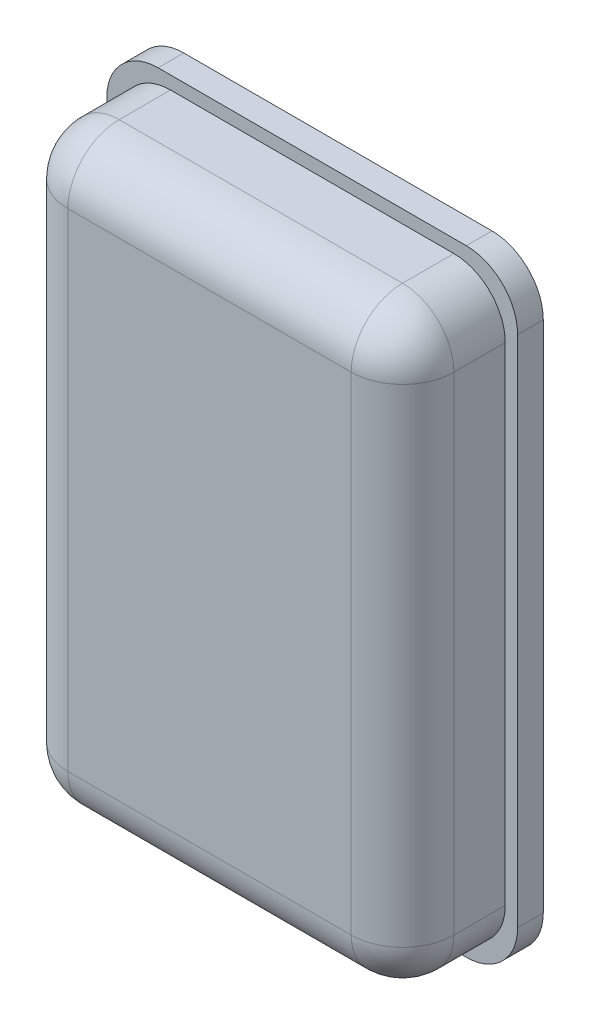
ISO-10303-21;
HEADER;
FILE_DESCRIPTION(('STEP AP214'),'2;1');
FILE_NAME('part.step','',(''),(''),'','','');
FILE_SCHEMA(('AUTOMOTIVE_DESIGN { 1 0 10303 214 1 1 1 1 }'));
ENDSEC;
DATA;
#1=APPLICATION_CONTEXT('core data for automotive mechanical design processes');
#2=APPLICATION_PROTOCOL_DEFINITION('international standard','automotive_design',2000,#1);
#3=PRODUCT_CONTEXT('',#1,'mechanical');
#4=PRODUCT('Part','Part','',(#3));
#5=PRODUCT_RELATED_PRODUCT_CATEGORY('part','',(#4));
#6=PRODUCT_DEFINITION_FORMATION('','',#4);
#7=PRODUCT_DEFINITION_CONTEXT('part definition',#1,'design');
#8=PRODUCT_DEFINITION('design','',#6,#7);
#9=PRODUCT_DEFINITION_SHAPE('','',#8);
#10=(LENGTH_UNIT() NAMED_UNIT(*) SI_UNIT(.MILLI.,.METRE.));
#11=(NAMED_UNIT(*) PLANE_ANGLE_UNIT() SI_UNIT($,.RADIAN.));
#12=(NAMED_UNIT(*) SI_UNIT($,.STERADIAN.) SOLID_ANGLE_UNIT());
#13=UNCERTAINTY_MEASURE_WITH_UNIT(LENGTH_MEASURE(1.E-05),#10,'distance_accuracy_value','');
#14=(GEOMETRIC_REPRESENTATION_CONTEXT(3) GLOBAL_UNCERTAINTY_ASSIGNED_CONTEXT((#13)) GLOBAL_UNIT_ASSIGNED_CONTEXT((#10,
#11,#12)) REPRESENTATION_CONTEXT('',''));
#15=CARTESIAN_POINT('',(0.,0.,0.));
#16=DIRECTION('',(0.,0.,1.));
#17=DIRECTION('',(1.,0.,0.));
#18=AXIS2_PLACEMENT_3D('',#15,#16,#17);
#19=CARTESIAN_POINT('',(37.5887952689364,57.4644174029834,25.));
#20=DIRECTION('',(-1.,0.,0.));
#21=DIRECTION('',(0.,0.,1.));
#22=AXIS2_PLACEMENT_3D('',#19,#20,#21);
#23=PLANE('',#22);
#24=DIRECTION('',(0.,1.,0.));
#25=VECTOR('',#24,1.);
#26=CARTESIAN_POINT('',(37.5887952689364,-57.4644174029834,15.));
#27=LINE('',#26,#25);
#28=CARTESIAN_POINT('',(37.5887952689364,47.4644174029834,15.));
#29=VERTEX_POINT('',#28);
#30=CARTESIAN_POINT('',(37.5887952689364,-47.4644174029834,15.));
#31=VERTEX_POINT('',#30);
#32=EDGE_CURVE('E67',#29,#31,#27,.F.);
#33=ORIENTED_EDGE('',*,*,#32,.T.);
#34=DIRECTION('',(0.,0.,-1.));
#35=VECTOR('',#34,1.);
#36=CARTESIAN_POINT('',(37.5887952689364,-47.4644174029834,25.));
#37=LINE('',#36,#35);
#38=CARTESIAN_POINT('',(37.5887952689364,-47.4644174029834,5.));
#39=VERTEX_POINT('',#38);
#40=EDGE_CURVE('E202',#31,#39,#37,.T.);
#41=ORIENTED_EDGE('',*,*,#40,.T.);
#42=DIRECTION('',(0.,1.,0.));
#43=VECTOR('',#42,1.);
#44=CARTESIAN_POINT('',(37.5887952689364,57.4644174029834,5.));
#45=LINE('',#44,#43);
#46=CARTESIAN_POINT('',(37.5887952689364,47.4644174029834,5.));
#47=VERTEX_POINT('',#46);
#48=EDGE_CURVE('E245',#39,#47,#45,.T.);
#49=ORIENTED_EDGE('',*,*,#48,.T.);
#50=DIRECTION('',(0.,0.,-1.));
#51=VECTOR('',#50,1.);
#52=CARTESIAN_POINT('',(37.5887952689364,47.4644174029834,25.));
#53=LINE('',#52,#51);
#54=EDGE_CURVE('E72',#47,#29,#53,.F.);
#55=ORIENTED_EDGE('',*,*,#54,.T.);
#56=EDGE_LOOP('',(#33,#41,#49,#55));
#57=FACE_BOUND('',#56,.T.);
#58=ADVANCED_FACE('F49',(#57),#23,.F.);
#59=CARTESIAN_POINT('',(-37.5887952689364,57.4644174029834,25.));
#60=DIRECTION('',(0.,-1.,0.));
#61=DIRECTION('',(0.,0.,-1.));
#62=AXIS2_PLACEMENT_3D('',#59,#60,#61);
#63=PLANE('',#62);
#64=DIRECTION('',(-1.,0.,0.));
#65=VECTOR('',#64,1.);
#66=CARTESIAN_POINT('',(-37.5887952689364,57.4644174029834,5.));
#67=LINE('',#66,#65);
#68=CARTESIAN_POINT('',(27.5887952689364,57.4644174029834,5.));
#69=VERTEX_POINT('',#68);
#70=CARTESIAN_POINT('',(-27.5887952689364,57.4644174029834,5.));
#71=VERTEX_POINT('',#70);
#72=EDGE_CURVE('E248',#69,#71,#67,.T.);
#73=ORIENTED_EDGE('',*,*,#72,.T.);
#74=DIRECTION('',(0.,0.,-1.));
#75=VECTOR('',#74,1.);
#76=CARTESIAN_POINT('',(-27.5887952689364,57.4644174029834,25.));
#77=LINE('',#76,#75);
#78=CARTESIAN_POINT('',(-27.5887952689364,57.4644174029834,15.));
#79=VERTEX_POINT('',#78);
#80=EDGE_CURVE('E195',#71,#79,#77,.F.);
#81=ORIENTED_EDGE('',*,*,#80,.T.);
#82=DIRECTION('',(-1.,0.,0.));
#83=VECTOR('',#82,1.);
#84=CARTESIAN_POINT('',(37.5887952689364,57.4644174029834,15.));
#85=LINE('',#84,#83);
#86=CARTESIAN_POINT('',(27.5887952689364,57.4644174029834,15.));
#87=VERTEX_POINT('',#86);
#88=EDGE_CURVE('E192',#79,#87,#85,.F.);
#89=ORIENTED_EDGE('',*,*,#88,.T.);
#90=DIRECTION('',(0.,0.,-1.));
#91=VECTOR('',#90,1.);
#92=CARTESIAN_POINT('',(27.5887952689364,57.4644174029834,25.));
#93=LINE('',#92,#91);
#94=EDGE_CURVE('E189',#87,#69,#93,.T.);
#95=ORIENTED_EDGE('',*,*,#94,.T.);
#96=EDGE_LOOP('',(#73,#81,#89,#95));
#97=FACE_BOUND('',#96,.T.);
#98=ADVANCED_FACE('F305',(#97),#63,.F.);
#99=CARTESIAN_POINT('',(-37.5887952689364,57.4644174029834,25.));
#100=DIRECTION('',(1.,0.,0.));
#101=DIRECTION('',(0.,0.,-1.));
#102=AXIS2_PLACEMENT_3D('',#99,#100,#101);
#103=PLANE('',#102);
#104=DIRECTION('',(0.,-1.,0.));
#105=VECTOR('',#104,1.);
#106=CARTESIAN_POINT('',(-37.5887952689364,57.4644174029834,15.));
#107=LINE('',#106,#105);
#108=CARTESIAN_POINT('',(-37.5887952689364,-47.4644174029834,15.));
#109=VERTEX_POINT('',#108);
#110=CARTESIAN_POINT('',(-37.5887952689364,47.4644174029834,15.));
#111=VERTEX_POINT('',#110);
#112=EDGE_CURVE('E183',#109,#111,#107,.F.);
#113=ORIENTED_EDGE('',*,*,#112,.T.);
#114=DIRECTION('',(0.,0.,-1.));
#115=VECTOR('',#114,1.);
#116=CARTESIAN_POINT('',(-37.5887952689364,47.4644174029834,25.));
#117=LINE('',#116,#115);
#118=CARTESIAN_POINT('',(-37.5887952689364,47.4644174029834,5.));
#119=VERTEX_POINT('',#118);
#120=EDGE_CURVE('E186',#111,#119,#117,.T.);
#121=ORIENTED_EDGE('',*,*,#120,.T.);
#122=DIRECTION('',(0.,-1.,0.));
#123=VECTOR('',#122,1.);
#124=CARTESIAN_POINT('',(-37.5887952689364,57.4644174029834,5.));
#125=LINE('',#124,#123);
#126=CARTESIAN_POINT('',(-37.5887952689364,-47.4644174029834,5.));
#127=VERTEX_POINT('',#126);
#128=EDGE_CURVE('E253',#119,#127,#125,.T.);
#129=ORIENTED_EDGE('',*,*,#128,.T.);
#130=DIRECTION('',(0.,0.,-1.));
#131=VECTOR('',#130,1.);
#132=CARTESIAN_POINT('',(-37.5887952689364,-47.4644174029834,25.));
#133=LINE('',#132,#131);
#134=EDGE_CURVE('E180',#127,#109,#133,.F.);
#135=ORIENTED_EDGE('',*,*,#134,.T.);
#136=EDGE_LOOP('',(#113,#121,#129,#135));
#137=FACE_BOUND('',#136,.T.);
#138=ADVANCED_FACE('F310',(#137),#103,.F.);
#139=CARTESIAN_POINT('',(-37.5887952689364,-57.4644174029834,25.));
#140=DIRECTION('',(0.,1.,0.));
#141=DIRECTION('',(0.,0.,1.));
#142=AXIS2_PLACEMENT_3D('',#139,#140,#141);
#143=PLANE('',#142);
#144=DIRECTION('',(1.,0.,0.));
#145=VECTOR('',#144,1.);
#146=CARTESIAN_POINT('',(-37.5887952689364,-57.4644174029834,15.));
#147=LINE('',#146,#145);
#148=CARTESIAN_POINT('',(27.5887952689364,-57.4644174029834,15.));
#149=VERTEX_POINT('',#148);
#150=CARTESIAN_POINT('',(-27.5887952689364,-57.4644174029834,15.));
#151=VERTEX_POINT('',#150);
#152=EDGE_CURVE('E135',#149,#151,#147,.F.);
#153=ORIENTED_EDGE('',*,*,#152,.T.);
#154=DIRECTION('',(0.,0.,-1.));
#155=VECTOR('',#154,1.);
#156=CARTESIAN_POINT('',(-27.5887952689364,-57.4644174029834,25.));
#157=LINE('',#156,#155);
#158=CARTESIAN_POINT('',(-27.5887952689364,-57.4644174029834,5.));
#159=VERTEX_POINT('',#158);
#160=EDGE_CURVE('E177',#151,#159,#157,.T.);
#161=ORIENTED_EDGE('',*,*,#160,.T.);
#162=DIRECTION('',(1.,0.,0.));
#163=VECTOR('',#162,1.);
#164=CARTESIAN_POINT('',(-37.5887952689364,-57.4644174029834,5.));
#165=LINE('',#164,#163);
#166=CARTESIAN_POINT('',(27.5887952689364,-57.4644174029834,5.));
#167=VERTEX_POINT('',#166);
#168=EDGE_CURVE('E160',#159,#167,#165,.T.);
#169=ORIENTED_EDGE('',*,*,#168,.T.);
#170=DIRECTION('',(0.,0.,-1.));
#171=VECTOR('',#170,1.);
#172=CARTESIAN_POINT('',(27.5887952689364,-57.4644174029834,25.));
#173=LINE('',#172,#171);
#174=EDGE_CURVE('E167',#167,#149,#173,.F.);
#175=ORIENTED_EDGE('',*,*,#174,.T.);
#176=EDGE_LOOP('',(#153,#161,#169,#175));
#177=FACE_BOUND('',#176,.T.);
#178=ADVANCED_FACE('F281',(#177),#143,.F.);
#179=CARTESIAN_POINT('',(0.,0.,25.));
#180=DIRECTION('',(0.,0.,1.));
#181=DIRECTION('',(1.,0.,0.));
#182=AXIS2_PLACEMENT_3D('',#179,#180,#181);
#183=PLANE('',#182);
#184=DIRECTION('',(0.,-1.,0.));
#185=VECTOR('',#184,1.);
#186=CARTESIAN_POINT('',(-27.5887952689364,-57.4644174029834,25.));
#187=LINE('',#186,#185);
#188=CARTESIAN_POINT('',(-27.5887952689364,47.4644174029834,25.));
#189=VERTEX_POINT('',#188);
#190=CARTESIAN_POINT('',(-27.5887952689364,-47.4644174029834,25.));
#191=VERTEX_POINT('',#190);
#192=EDGE_CURVE('E164',#189,#191,#187,.T.);
#193=ORIENTED_EDGE('',*,*,#192,.T.);
#194=DIRECTION('',(1.,0.,0.));
#195=VECTOR('',#194,1.);
#196=CARTESIAN_POINT('',(37.5887952689364,-47.4644174029834,25.));
#197=LINE('',#196,#195);
#198=CARTESIAN_POINT('',(27.5887952689364,-47.4644174029834,25.));
#199=VERTEX_POINT('',#198);
#200=EDGE_CURVE('E133',#191,#199,#197,.T.);
#201=ORIENTED_EDGE('',*,*,#200,.T.);
#202=DIRECTION('',(0.,1.,0.));
#203=VECTOR('',#202,1.);
#204=CARTESIAN_POINT('',(27.5887952689364,57.4644174029834,25.));
#205=LINE('',#204,#203);
#206=CARTESIAN_POINT('',(27.5887952689364,47.4644174029834,25.));
#207=VERTEX_POINT('',#206);
#208=EDGE_CURVE('E152',#199,#207,#205,.T.);
#209=ORIENTED_EDGE('',*,*,#208,.T.);
#210=DIRECTION('',(-1.,0.,0.));
#211=VECTOR('',#210,1.);
#212=CARTESIAN_POINT('',(-37.5887952689364,47.4644174029834,25.));
#213=LINE('',#212,#211);
#214=EDGE_CURVE('E159',#207,#189,#213,.T.);
#215=ORIENTED_EDGE('',*,*,#214,.T.);
#216=EDGE_LOOP('',(#193,#201,#209,#215));
#217=FACE_BOUND('',#216,.T.);
#218=ADVANCED_FACE('F162',(#217),#183,.T.);
#219=CARTESIAN_POINT('',(0.,0.,5.));
#220=DIRECTION('',(0.,0.,1.));
#221=DIRECTION('',(1.,0.,0.));
#222=AXIS2_PLACEMENT_3D('',#219,#220,#221);
#223=PLANE('',#222);
#224=ORIENTED_EDGE('',*,*,#128,.F.);
#225=CARTESIAN_POINT('',(-27.5887952689364,47.4644174029834,5.));
#226=DIRECTION('',(0.,0.,1.));
#227=DIRECTION('',(1.,0.,0.));
#228=AXIS2_PLACEMENT_3D('',#225,#226,#227);
#229=CIRCLE('',#228,10.);
#230=EDGE_CURVE('E12',#119,#71,#229,.F.);
#231=ORIENTED_EDGE('',*,*,#230,.T.);
#232=ORIENTED_EDGE('',*,*,#72,.F.);
#233=CARTESIAN_POINT('',(27.5887952689364,47.4644174029834,5.));
#234=DIRECTION('',(0.,0.,1.));
#235=DIRECTION('',(1.,0.,0.));
#236=AXIS2_PLACEMENT_3D('',#233,#234,#235);
#237=CIRCLE('',#236,10.);
#238=EDGE_CURVE('E205',#69,#47,#237,.F.);
#239=ORIENTED_EDGE('',*,*,#238,.T.);
#240=ORIENTED_EDGE('',*,*,#48,.F.);
#241=CARTESIAN_POINT('',(27.5887952689364,-47.4644174029834,5.));
#242=DIRECTION('',(0.,0.,1.));
#243=DIRECTION('',(1.,0.,0.));
#244=AXIS2_PLACEMENT_3D('',#241,#242,#243);
#245=CIRCLE('',#244,10.);
#246=EDGE_CURVE('E208',#39,#167,#245,.F.);
#247=ORIENTED_EDGE('',*,*,#246,.T.);
#248=ORIENTED_EDGE('',*,*,#168,.F.);
#249=CARTESIAN_POINT('',(-27.5887952689364,-47.4644174029834,5.));
#250=DIRECTION('',(0.,0.,1.));
#251=DIRECTION('',(1.,0.,0.));
#252=AXIS2_PLACEMENT_3D('',#249,#250,#251);
#253=CIRCLE('',#252,10.);
#254=EDGE_CURVE('E59',#159,#127,#253,.F.);
#255=ORIENTED_EDGE('',*,*,#254,.T.);
#256=EDGE_LOOP('',(#224,#231,#232,#239,#240,#247,#248,#255));
#257=FACE_BOUND('',#256,.T.);
#258=ADVANCED_FACE('F288',(#257),#223,.F.);
#259=CARTESIAN_POINT('',(-27.5887952689364,47.4644174029834,25.));
#260=DIRECTION('',(0.,0.,-1.));
#261=DIRECTION('',(-1.,0.,0.));
#262=AXIS2_PLACEMENT_3D('',#259,#260,#261);
#263=CYLINDRICAL_SURFACE('',#262,10.);
#264=ORIENTED_EDGE('',*,*,#230,.F.);
#265=ORIENTED_EDGE('',*,*,#120,.F.);
#266=CARTESIAN_POINT('',(-27.5887952689364,47.4644174029834,15.));
#267=DIRECTION('',(0.,0.,1.));
#268=DIRECTION('',(1.,0.,0.));
#269=AXIS2_PLACEMENT_3D('',#266,#267,#268);
#270=CIRCLE('',#269,10.);
#271=EDGE_CURVE('E53',#79,#111,#270,.T.);
#272=ORIENTED_EDGE('',*,*,#271,.F.);
#273=ORIENTED_EDGE('',*,*,#80,.F.);
#274=EDGE_LOOP('',(#264,#265,#272,#273));
#275=FACE_BOUND('',#274,.T.);
#276=ADVANCED_FACE('F51',(#275),#263,.T.);
#277=CARTESIAN_POINT('',(0.,47.4644174029834,15.));
#278=DIRECTION('',(1.,0.,0.));
#279=DIRECTION('',(0.,0.,-1.));
#280=AXIS2_PLACEMENT_3D('',#277,#278,#279);
#281=CYLINDRICAL_SURFACE('',#280,10.);
#282=CARTESIAN_POINT('',(27.5887952689364,47.4644174029834,15.));
#283=DIRECTION('',(1.,0.,0.));
#284=DIRECTION('',(0.,0.,-1.));
#285=AXIS2_PLACEMENT_3D('',#282,#283,#284);
#286=CIRCLE('',#285,10.);
#287=EDGE_CURVE('E234',#87,#207,#286,.T.);
#288=ORIENTED_EDGE('',*,*,#287,.F.);
#289=ORIENTED_EDGE('',*,*,#88,.F.);
#290=CARTESIAN_POINT('',(-27.5887952689364,47.4644174029834,15.));
#291=DIRECTION('',(-1.,0.,0.));
#292=DIRECTION('',(0.,0.,1.));
#293=AXIS2_PLACEMENT_3D('',#290,#291,#292);
#294=CIRCLE('',#293,10.);
#295=EDGE_CURVE('E237',#189,#79,#294,.T.);
#296=ORIENTED_EDGE('',*,*,#295,.F.);
#297=ORIENTED_EDGE('',*,*,#214,.F.);
#298=EDGE_LOOP('',(#288,#289,#296,#297));
#299=FACE_BOUND('',#298,.T.);
#300=ADVANCED_FACE('F265',(#299),#281,.T.);
#301=CARTESIAN_POINT('',(27.5887952689364,47.4644174029834,25.));
#302=DIRECTION('',(0.,0.,-1.));
#303=DIRECTION('',(-1.,0.,0.));
#304=AXIS2_PLACEMENT_3D('',#301,#302,#303);
#305=CYLINDRICAL_SURFACE('',#304,10.);
#306=ORIENTED_EDGE('',*,*,#238,.F.);
#307=ORIENTED_EDGE('',*,*,#94,.F.);
#308=CARTESIAN_POINT('',(27.5887952689364,47.4644174029834,15.));
#309=DIRECTION('',(0.,0.,1.));
#310=DIRECTION('',(1.,0.,0.));
#311=AXIS2_PLACEMENT_3D('',#308,#309,#310);
#312=CIRCLE('',#311,10.);
#313=EDGE_CURVE('E230',#29,#87,#312,.T.);
#314=ORIENTED_EDGE('',*,*,#313,.F.);
#315=ORIENTED_EDGE('',*,*,#54,.F.);
#316=EDGE_LOOP('',(#306,#307,#314,#315));
#317=FACE_BOUND('',#316,.T.);
#318=ADVANCED_FACE('F293',(#317),#305,.T.);
#319=CARTESIAN_POINT('',(-27.5887952689364,47.4644174029834,15.));
#320=DIRECTION('',(0.,1.,0.));
#321=DIRECTION('',(0.,0.,1.));
#322=AXIS2_PLACEMENT_3D('',#319,#320,#321);
#323=SPHERICAL_SURFACE('',#322,10.);
#324=ORIENTED_EDGE('',*,*,#295,.T.);
#325=ORIENTED_EDGE('',*,*,#271,.T.);
#326=CARTESIAN_POINT('',(-27.5887952689364,47.4644174029834,15.));
#327=DIRECTION('',(0.,1.,0.));
#328=DIRECTION('',(0.,0.,1.));
#329=AXIS2_PLACEMENT_3D('',#326,#327,#328);
#330=CIRCLE('',#329,10.);
#331=EDGE_CURVE('E226',#189,#111,#330,.F.);
#332=ORIENTED_EDGE('',*,*,#331,.F.);
#333=EDGE_LOOP('',(#324,#325,#332));
#334=FACE_BOUND('',#333,.T.);
#335=ADVANCED_FACE('F266',(#334),#323,.T.);
#336=CARTESIAN_POINT('',(27.5887952689364,47.4644174029834,15.));
#337=DIRECTION('',(0.,1.,0.));
#338=DIRECTION('',(-1.,0.,0.));
#339=AXIS2_PLACEMENT_3D('',#336,#337,#338);
#340=SPHERICAL_SURFACE('',#339,10.);
#341=ORIENTED_EDGE('',*,*,#313,.T.);
#342=ORIENTED_EDGE('',*,*,#287,.T.);
#343=CARTESIAN_POINT('',(27.5887952689364,47.4644174029834,15.));
#344=DIRECTION('',(0.,1.,0.));
#345=DIRECTION('',(0.,0.,1.));
#346=AXIS2_PLACEMENT_3D('',#343,#344,#345);
#347=CIRCLE('',#346,10.);
#348=EDGE_CURVE('E155',#29,#207,#347,.F.);
#349=ORIENTED_EDGE('',*,*,#348,.F.);
#350=EDGE_LOOP('',(#341,#342,#349));
#351=FACE_BOUND('',#350,.T.);
#352=ADVANCED_FACE('F295',(#351),#340,.T.);
#353=CARTESIAN_POINT('',(-27.5887952689364,-47.4644174029834,25.));
#354=DIRECTION('',(0.,0.,-1.));
#355=DIRECTION('',(-1.,0.,0.));
#356=AXIS2_PLACEMENT_3D('',#353,#354,#355);
#357=CYLINDRICAL_SURFACE('',#356,10.);
#358=ORIENTED_EDGE('',*,*,#254,.F.);
#359=ORIENTED_EDGE('',*,*,#160,.F.);
#360=CARTESIAN_POINT('',(-27.5887952689364,-47.4644174029834,15.));
#361=DIRECTION('',(0.,0.,1.));
#362=DIRECTION('',(1.,0.,0.));
#363=AXIS2_PLACEMENT_3D('',#360,#361,#362);
#364=CIRCLE('',#363,10.);
#365=EDGE_CURVE('E220',#109,#151,#364,.T.);
#366=ORIENTED_EDGE('',*,*,#365,.F.);
#367=ORIENTED_EDGE('',*,*,#134,.F.);
#368=EDGE_LOOP('',(#358,#359,#366,#367));
#369=FACE_BOUND('',#368,.T.);
#370=ADVANCED_FACE('F278',(#369),#357,.T.);
#371=CARTESIAN_POINT('',(-27.5887952689364,0.,15.));
#372=DIRECTION('',(0.,1.,0.));
#373=DIRECTION('',(0.,0.,1.));
#374=AXIS2_PLACEMENT_3D('',#371,#372,#373);
#375=CYLINDRICAL_SURFACE('',#374,10.);
#376=ORIENTED_EDGE('',*,*,#331,.T.);
#377=ORIENTED_EDGE('',*,*,#112,.F.);
#378=CARTESIAN_POINT('',(-27.5887952689364,-47.4644174029834,15.));
#379=DIRECTION('',(0.,-1.,0.));
#380=DIRECTION('',(0.,0.,-1.));
#381=AXIS2_PLACEMENT_3D('',#378,#379,#380);
#382=CIRCLE('',#381,10.);
#383=EDGE_CURVE('E149',#191,#109,#382,.T.);
#384=ORIENTED_EDGE('',*,*,#383,.F.);
#385=ORIENTED_EDGE('',*,*,#192,.F.);
#386=EDGE_LOOP('',(#376,#377,#384,#385));
#387=FACE_BOUND('',#386,.T.);
#388=ADVANCED_FACE('F269',(#387),#375,.T.);
#389=CARTESIAN_POINT('',(27.5887952689364,0.,15.));
#390=DIRECTION('',(0.,-1.,0.));
#391=DIRECTION('',(0.,0.,-1.));
#392=AXIS2_PLACEMENT_3D('',#389,#390,#391);
#393=CYLINDRICAL_SURFACE('',#392,10.);
#394=ORIENTED_EDGE('',*,*,#348,.T.);
#395=ORIENTED_EDGE('',*,*,#208,.F.);
#396=CARTESIAN_POINT('',(27.5887952689364,-47.4644174029834,15.));
#397=DIRECTION('',(0.,-1.,0.));
#398=DIRECTION('',(0.,0.,-1.));
#399=AXIS2_PLACEMENT_3D('',#396,#397,#398);
#400=CIRCLE('',#399,10.);
#401=EDGE_CURVE('E142',#31,#199,#400,.T.);
#402=ORIENTED_EDGE('',*,*,#401,.F.);
#403=ORIENTED_EDGE('',*,*,#32,.F.);
#404=EDGE_LOOP('',(#394,#395,#402,#403));
#405=FACE_BOUND('',#404,.T.);
#406=ADVANCED_FACE('F153',(#405),#393,.T.);
#407=CARTESIAN_POINT('',(27.5887952689364,-47.4644174029834,25.));
#408=DIRECTION('',(0.,0.,-1.));
#409=DIRECTION('',(-1.,0.,0.));
#410=AXIS2_PLACEMENT_3D('',#407,#408,#409);
#411=CYLINDRICAL_SURFACE('',#410,10.);
#412=ORIENTED_EDGE('',*,*,#246,.F.);
#413=ORIENTED_EDGE('',*,*,#40,.F.);
#414=CARTESIAN_POINT('',(27.5887952689364,-47.4644174029834,15.));
#415=DIRECTION('',(0.,0.,1.));
#416=DIRECTION('',(1.,0.,0.));
#417=AXIS2_PLACEMENT_3D('',#414,#415,#416);
#418=CIRCLE('',#417,10.);
#419=EDGE_CURVE('E146',#149,#31,#418,.T.);
#420=ORIENTED_EDGE('',*,*,#419,.F.);
#421=ORIENTED_EDGE('',*,*,#174,.F.);
#422=EDGE_LOOP('',(#412,#413,#420,#421));
#423=FACE_BOUND('',#422,.T.);
#424=ADVANCED_FACE('F285',(#423),#411,.T.);
#425=CARTESIAN_POINT('',(-27.5887952689364,-47.4644174029834,15.));
#426=DIRECTION('',(-1.,0.,0.));
#427=DIRECTION('',(0.,0.,1.));
#428=AXIS2_PLACEMENT_3D('',#425,#426,#427);
#429=SPHERICAL_SURFACE('',#428,10.);
#430=ORIENTED_EDGE('',*,*,#383,.T.);
#431=ORIENTED_EDGE('',*,*,#365,.T.);
#432=CARTESIAN_POINT('',(-27.5887952689364,-47.4644174029834,15.));
#433=DIRECTION('',(-1.,0.,0.));
#434=DIRECTION('',(0.,0.,1.));
#435=AXIS2_PLACEMENT_3D('',#432,#433,#434);
#436=CIRCLE('',#435,10.);
#437=EDGE_CURVE('E139',#191,#151,#436,.F.);
#438=ORIENTED_EDGE('',*,*,#437,.F.);
#439=EDGE_LOOP('',(#430,#431,#438));
#440=FACE_BOUND('',#439,.T.);
#441=ADVANCED_FACE('F273',(#440),#429,.T.);
#442=CARTESIAN_POINT('',(27.5887952689364,-47.4644174029834,15.));
#443=DIRECTION('',(1.,0.,0.));
#444=DIRECTION('',(0.,1.,0.));
#445=AXIS2_PLACEMENT_3D('',#442,#443,#444);
#446=SPHERICAL_SURFACE('',#445,10.);
#447=ORIENTED_EDGE('',*,*,#419,.T.);
#448=ORIENTED_EDGE('',*,*,#401,.T.);
#449=CARTESIAN_POINT('',(27.5887952689364,-47.4644174029834,15.));
#450=DIRECTION('',(1.,0.,0.));
#451=DIRECTION('',(0.,0.,-1.));
#452=AXIS2_PLACEMENT_3D('',#449,#450,#451);
#453=CIRCLE('',#452,10.);
#454=EDGE_CURVE('E129',#149,#199,#453,.F.);
#455=ORIENTED_EDGE('',*,*,#454,.F.);
#456=EDGE_LOOP('',(#447,#448,#455));
#457=FACE_BOUND('',#456,.T.);
#458=ADVANCED_FACE('F144',(#457),#446,.T.);
#459=CARTESIAN_POINT('',(0.,-47.4644174029834,15.));
#460=DIRECTION('',(-1.,0.,0.));
#461=DIRECTION('',(0.,0.,1.));
#462=AXIS2_PLACEMENT_3D('',#459,#460,#461);
#463=CYLINDRICAL_SURFACE('',#462,10.);
#464=ORIENTED_EDGE('',*,*,#437,.T.);
#465=ORIENTED_EDGE('',*,*,#152,.F.);
#466=ORIENTED_EDGE('',*,*,#454,.T.);
#467=ORIENTED_EDGE('',*,*,#200,.F.);
#468=EDGE_LOOP('',(#464,#465,#466,#467));
#469=FACE_BOUND('',#468,.T.);
#470=ADVANCED_FACE('F131',(#469),#463,.T.);
#471=CLOSED_SHELL('',(#58,#98,#138,#178,#218,#258,#276,#300,#318,#335,#352,#370,#388,#406,#424,
#441,#458,#470));
#472=MANIFOLD_SOLID_BREP('B2',#471);
#473=CARTESIAN_POINT('',(-40.,60.,5.));
#474=DIRECTION('',(1.,0.,0.));
#475=DIRECTION('',(0.,1.,0.));
#476=AXIS2_PLACEMENT_3D('',#473,#474,#475);
#477=PLANE('',#476);
#478=DIRECTION('',(0.,-1.,0.));
#479=VECTOR('',#478,1.);
#480=CARTESIAN_POINT('',(-40.,60.,0.));
#481=LINE('',#480,#479);
#482=CARTESIAN_POINT('',(-40.,50.,0.));
#483=VERTEX_POINT('',#482);
#484=CARTESIAN_POINT('',(-40.,-50.,0.));
#485=VERTEX_POINT('',#484);
#486=EDGE_CURVE('E541',#483,#485,#481,.T.);
#487=ORIENTED_EDGE('',*,*,#486,.T.);
#488=DIRECTION('',(0.,0.,-1.));
#489=VECTOR('',#488,1.);
#490=CARTESIAN_POINT('',(-40.,-50.,5.));
#491=LINE('',#490,#489);
#492=CARTESIAN_POINT('',(-40.,-50.,5.));
#493=VERTEX_POINT('',#492);
#494=EDGE_CURVE('E519',#485,#493,#491,.F.);
#495=ORIENTED_EDGE('',*,*,#494,.T.);
#496=DIRECTION('',(0.,-1.,0.));
#497=VECTOR('',#496,1.);
#498=CARTESIAN_POINT('',(-40.,60.,5.));
#499=LINE('',#498,#497);
#500=CARTESIAN_POINT('',(-40.,50.,5.));
#501=VERTEX_POINT('',#500);
#502=EDGE_CURVE('E550',#501,#493,#499,.T.);
#503=ORIENTED_EDGE('',*,*,#502,.F.);
#504=DIRECTION('',(0.,0.,-1.));
#505=VECTOR('',#504,1.);
#506=CARTESIAN_POINT('',(-40.,50.,5.));
#507=LINE('',#506,#505);
#508=EDGE_CURVE('E524',#501,#483,#507,.T.);
#509=ORIENTED_EDGE('',*,*,#508,.T.);
#510=EDGE_LOOP('',(#487,#495,#503,#509));
#511=FACE_BOUND('',#510,.T.);
#512=ADVANCED_FACE('F449',(#511),#477,.F.);
#513=CARTESIAN_POINT('',(40.,-60.,5.));
#514=DIRECTION('',(0.,1.,0.));
#515=DIRECTION('',(0.,0.,1.));
#516=AXIS2_PLACEMENT_3D('',#513,#514,#515);
#517=PLANE('',#516);
#518=DIRECTION('',(1.,0.,0.));
#519=VECTOR('',#518,1.);
#520=CARTESIAN_POINT('',(40.,-60.,5.));
#521=LINE('',#520,#519);
#522=CARTESIAN_POINT('',(-30.,-60.,5.));
#523=VERTEX_POINT('',#522);
#524=CARTESIAN_POINT('',(30.,-60.,5.));
#525=VERTEX_POINT('',#524);
#526=EDGE_CURVE('E534',#523,#525,#521,.T.);
#527=ORIENTED_EDGE('',*,*,#526,.F.);
#528=DIRECTION('',(0.,0.,-1.));
#529=VECTOR('',#528,1.);
#530=CARTESIAN_POINT('',(-30.,-60.,5.));
#531=LINE('',#530,#529);
#532=CARTESIAN_POINT('',(-30.,-60.,0.));
#533=VERTEX_POINT('',#532);
#534=EDGE_CURVE('E518',#523,#533,#531,.T.);
#535=ORIENTED_EDGE('',*,*,#534,.T.);
#536=DIRECTION('',(1.,0.,0.));
#537=VECTOR('',#536,1.);
#538=CARTESIAN_POINT('',(40.,-60.,0.));
#539=LINE('',#538,#537);
#540=CARTESIAN_POINT('',(30.,-60.,0.));
#541=VERTEX_POINT('',#540);
#542=EDGE_CURVE('E531',#533,#541,#539,.T.);
#543=ORIENTED_EDGE('',*,*,#542,.T.);
#544=DIRECTION('',(0.,0.,-1.));
#545=VECTOR('',#544,1.);
#546=CARTESIAN_POINT('',(30.,-60.,5.));
#547=LINE('',#546,#545);
#548=EDGE_CURVE('E536',#541,#525,#547,.F.);
#549=ORIENTED_EDGE('',*,*,#548,.T.);
#550=EDGE_LOOP('',(#527,#535,#543,#549));
#551=FACE_BOUND('',#550,.T.);
#552=ADVANCED_FACE('F530',(#551),#517,.F.);
#553=CARTESIAN_POINT('',(40.,60.,5.));
#554=DIRECTION('',(-1.,0.,0.));
#555=DIRECTION('',(0.,-1.,0.));
#556=AXIS2_PLACEMENT_3D('',#553,#554,#555);
#557=PLANE('',#556);
#558=DIRECTION('',(0.,1.,0.));
#559=VECTOR('',#558,1.);
#560=CARTESIAN_POINT('',(40.,60.,5.));
#561=LINE('',#560,#559);
#562=CARTESIAN_POINT('',(40.,-50.,5.));
#563=VERTEX_POINT('',#562);
#564=CARTESIAN_POINT('',(40.,50.,5.));
#565=VERTEX_POINT('',#564);
#566=EDGE_CURVE('E584',#563,#565,#561,.T.);
#567=ORIENTED_EDGE('',*,*,#566,.F.);
#568=DIRECTION('',(0.,0.,-1.));
#569=VECTOR('',#568,1.);
#570=CARTESIAN_POINT('',(40.,-50.,5.));
#571=LINE('',#570,#569);
#572=CARTESIAN_POINT('',(40.,-50.,0.));
#573=VERTEX_POINT('',#572);
#574=EDGE_CURVE('E569',#563,#573,#571,.T.);
#575=ORIENTED_EDGE('',*,*,#574,.T.);
#576=DIRECTION('',(0.,1.,0.));
#577=VECTOR('',#576,1.);
#578=CARTESIAN_POINT('',(40.,60.,0.));
#579=LINE('',#578,#577);
#580=CARTESIAN_POINT('',(40.,50.,0.));
#581=VERTEX_POINT('',#580);
#582=EDGE_CURVE('E540',#573,#581,#579,.T.);
#583=ORIENTED_EDGE('',*,*,#582,.T.);
#584=DIRECTION('',(0.,0.,-1.));
#585=VECTOR('',#584,1.);
#586=CARTESIAN_POINT('',(40.,50.,5.));
#587=LINE('',#586,#585);
#588=EDGE_CURVE('E567',#581,#565,#587,.F.);
#589=ORIENTED_EDGE('',*,*,#588,.T.);
#590=EDGE_LOOP('',(#567,#575,#583,#589));
#591=FACE_BOUND('',#590,.T.);
#592=ADVANCED_FACE('F595',(#591),#557,.F.);
#593=CARTESIAN_POINT('',(40.,60.,5.));
#594=DIRECTION('',(0.,-1.,0.));
#595=DIRECTION('',(0.,0.,-1.));
#596=AXIS2_PLACEMENT_3D('',#593,#594,#595);
#597=PLANE('',#596);
#598=DIRECTION('',(-1.,0.,0.));
#599=VECTOR('',#598,1.);
#600=CARTESIAN_POINT('',(40.,60.,0.));
#601=LINE('',#600,#599);
#602=CARTESIAN_POINT('',(30.,60.,0.));
#603=VERTEX_POINT('',#602);
#604=CARTESIAN_POINT('',(-30.,60.,0.));
#605=VERTEX_POINT('',#604);
#606=EDGE_CURVE('E544',#603,#605,#601,.T.);
#607=ORIENTED_EDGE('',*,*,#606,.T.);
#608=DIRECTION('',(0.,0.,-1.));
#609=VECTOR('',#608,1.);
#610=CARTESIAN_POINT('',(-30.,60.,5.));
#611=LINE('',#610,#609);
#612=CARTESIAN_POINT('',(-30.,60.,5.));
#613=VERTEX_POINT('',#612);
#614=EDGE_CURVE('E47',#605,#613,#611,.F.);
#615=ORIENTED_EDGE('',*,*,#614,.T.);
#616=DIRECTION('',(-1.,0.,0.));
#617=VECTOR('',#616,1.);
#618=CARTESIAN_POINT('',(40.,60.,5.));
#619=LINE('',#618,#617);
#620=CARTESIAN_POINT('',(30.,60.,5.));
#621=VERTEX_POINT('',#620);
#622=EDGE_CURVE('E551',#621,#613,#619,.T.);
#623=ORIENTED_EDGE('',*,*,#622,.F.);
#624=DIRECTION('',(0.,0.,-1.));
#625=VECTOR('',#624,1.);
#626=CARTESIAN_POINT('',(30.,60.,5.));
#627=LINE('',#626,#625);
#628=EDGE_CURVE('E457',#621,#603,#627,.T.);
#629=ORIENTED_EDGE('',*,*,#628,.T.);
#630=EDGE_LOOP('',(#607,#615,#623,#629));
#631=FACE_BOUND('',#630,.T.);
#632=ADVANCED_FACE('F574',(#631),#597,.F.);
#633=CARTESIAN_POINT('',(0.,0.,5.));
#634=DIRECTION('',(0.,0.,-1.));
#635=DIRECTION('',(-1.,0.,0.));
#636=AXIS2_PLACEMENT_3D('',#633,#634,#635);
#637=PLANE('',#636);
#638=ORIENTED_EDGE('',*,*,#502,.T.);
#639=CARTESIAN_POINT('',(-30.,-50.,5.));
#640=DIRECTION('',(0.,0.,-1.));
#641=DIRECTION('',(-1.,0.,0.));
#642=AXIS2_PLACEMENT_3D('',#639,#640,#641);
#643=CIRCLE('',#642,10.);
#644=EDGE_CURVE('E565',#493,#523,#643,.F.);
#645=ORIENTED_EDGE('',*,*,#644,.T.);
#646=ORIENTED_EDGE('',*,*,#526,.T.);
#647=CARTESIAN_POINT('',(30.,-50.,5.));
#648=DIRECTION('',(0.,0.,-1.));
#649=DIRECTION('',(-1.,0.,0.));
#650=AXIS2_PLACEMENT_3D('',#647,#648,#649);
#651=CIRCLE('',#650,10.);
#652=EDGE_CURVE('E563',#525,#563,#651,.F.);
#653=ORIENTED_EDGE('',*,*,#652,.T.);
#654=ORIENTED_EDGE('',*,*,#566,.T.);
#655=CARTESIAN_POINT('',(30.,50.,5.));
#656=DIRECTION('',(0.,0.,-1.));
#657=DIRECTION('',(-1.,0.,0.));
#658=AXIS2_PLACEMENT_3D('',#655,#656,#657);
#659=CIRCLE('',#658,10.);
#660=EDGE_CURVE('E469',#565,#621,#659,.F.);
#661=ORIENTED_EDGE('',*,*,#660,.T.);
#662=ORIENTED_EDGE('',*,*,#622,.T.);
#663=CARTESIAN_POINT('',(-30.,50.,5.));
#664=DIRECTION('',(0.,0.,-1.));
#665=DIRECTION('',(-1.,0.,0.));
#666=AXIS2_PLACEMENT_3D('',#663,#664,#665);
#667=CIRCLE('',#666,10.);
#668=EDGE_CURVE('E561',#613,#501,#667,.F.);
#669=ORIENTED_EDGE('',*,*,#668,.T.);
#670=EDGE_LOOP('',(#638,#645,#646,#653,#654,#661,#662,#669));
#671=FACE_BOUND('',#670,.T.);
#672=ADVANCED_FACE('F587',(#671),#637,.F.);
#673=CARTESIAN_POINT('',(0.,0.,0.));
#674=DIRECTION('',(0.,0.,-1.));
#675=DIRECTION('',(-1.,0.,0.));
#676=AXIS2_PLACEMENT_3D('',#673,#674,#675);
#677=PLANE('',#676);
#678=ORIENTED_EDGE('',*,*,#542,.F.);
#679=CARTESIAN_POINT('',(-30.,-50.,0.));
#680=DIRECTION('',(0.,0.,-1.));
#681=DIRECTION('',(-1.,0.,0.));
#682=AXIS2_PLACEMENT_3D('',#679,#680,#681);
#683=CIRCLE('',#682,10.);
#684=EDGE_CURVE('E514',#533,#485,#683,.T.);
#685=ORIENTED_EDGE('',*,*,#684,.T.);
#686=ORIENTED_EDGE('',*,*,#486,.F.);
#687=CARTESIAN_POINT('',(-30.,50.,0.));
#688=DIRECTION('',(0.,0.,-1.));
#689=DIRECTION('',(-1.,0.,0.));
#690=AXIS2_PLACEMENT_3D('',#687,#688,#689);
#691=CIRCLE('',#690,10.);
#692=EDGE_CURVE('E554',#483,#605,#691,.T.);
#693=ORIENTED_EDGE('',*,*,#692,.T.);
#694=ORIENTED_EDGE('',*,*,#606,.F.);
#695=CARTESIAN_POINT('',(30.,50.,0.));
#696=DIRECTION('',(0.,0.,-1.));
#697=DIRECTION('',(-1.,0.,0.));
#698=AXIS2_PLACEMENT_3D('',#695,#696,#697);
#699=CIRCLE('',#698,10.);
#700=EDGE_CURVE('E535',#603,#581,#699,.T.);
#701=ORIENTED_EDGE('',*,*,#700,.T.);
#702=ORIENTED_EDGE('',*,*,#582,.F.);
#703=CARTESIAN_POINT('',(30.,-50.,0.));
#704=DIRECTION('',(0.,0.,-1.));
#705=DIRECTION('',(-1.,0.,0.));
#706=AXIS2_PLACEMENT_3D('',#703,#704,#705);
#707=CIRCLE('',#706,10.);
#708=EDGE_CURVE('E525',#573,#541,#707,.T.);
#709=ORIENTED_EDGE('',*,*,#708,.T.);
#710=EDGE_LOOP('',(#678,#685,#686,#693,#694,#701,#702,#709));
#711=FACE_BOUND('',#710,.T.);
#712=ADVANCED_FACE('F538',(#711),#677,.T.);
#713=CARTESIAN_POINT('',(-30.,-50.,5.));
#714=DIRECTION('',(0.,0.,-1.));
#715=DIRECTION('',(-1.,0.,0.));
#716=AXIS2_PLACEMENT_3D('',#713,#714,#715);
#717=CYLINDRICAL_SURFACE('',#716,10.);
#718=ORIENTED_EDGE('',*,*,#644,.F.);
#719=ORIENTED_EDGE('',*,*,#494,.F.);
#720=ORIENTED_EDGE('',*,*,#684,.F.);
#721=ORIENTED_EDGE('',*,*,#534,.F.);
#722=EDGE_LOOP('',(#718,#719,#720,#721));
#723=FACE_BOUND('',#722,.T.);
#724=ADVANCED_FACE('F517',(#723),#717,.T.);
#725=CARTESIAN_POINT('',(30.,-50.,5.));
#726=DIRECTION('',(0.,0.,-1.));
#727=DIRECTION('',(-1.,0.,0.));
#728=AXIS2_PLACEMENT_3D('',#725,#726,#727);
#729=CYLINDRICAL_SURFACE('',#728,10.);
#730=ORIENTED_EDGE('',*,*,#652,.F.);
#731=ORIENTED_EDGE('',*,*,#548,.F.);
#732=ORIENTED_EDGE('',*,*,#708,.F.);
#733=ORIENTED_EDGE('',*,*,#574,.F.);
#734=EDGE_LOOP('',(#730,#731,#732,#733));
#735=FACE_BOUND('',#734,.T.);
#736=ADVANCED_FACE('F607',(#735),#729,.T.);
#737=CARTESIAN_POINT('',(-30.,50.,5.));
#738=DIRECTION('',(0.,0.,-1.));
#739=DIRECTION('',(-1.,0.,0.));
#740=AXIS2_PLACEMENT_3D('',#737,#738,#739);
#741=CYLINDRICAL_SURFACE('',#740,10.);
#742=ORIENTED_EDGE('',*,*,#668,.F.);
#743=ORIENTED_EDGE('',*,*,#614,.F.);
#744=ORIENTED_EDGE('',*,*,#692,.F.);
#745=ORIENTED_EDGE('',*,*,#508,.F.);
#746=EDGE_LOOP('',(#742,#743,#744,#745));
#747=FACE_BOUND('',#746,.T.);
#748=ADVANCED_FACE('F579',(#747),#741,.T.);
#749=CARTESIAN_POINT('',(30.,50.,5.));
#750=DIRECTION('',(0.,0.,-1.));
#751=DIRECTION('',(-1.,0.,0.));
#752=AXIS2_PLACEMENT_3D('',#749,#750,#751);
#753=CYLINDRICAL_SURFACE('',#752,10.);
#754=ORIENTED_EDGE('',*,*,#660,.F.);
#755=ORIENTED_EDGE('',*,*,#588,.F.);
#756=ORIENTED_EDGE('',*,*,#700,.F.);
#757=ORIENTED_EDGE('',*,*,#628,.F.);
#758=EDGE_LOOP('',(#754,#755,#756,#757));
#759=FACE_BOUND('',#758,.T.);
#760=ADVANCED_FACE('F451',(#759),#753,.T.);
#761=CLOSED_SHELL('',(#512,#552,#592,#632,#672,#712,#724,#736,#748,#760));
#762=MANIFOLD_SOLID_BREP('B6',#761);
#763=ADVANCED_BREP_SHAPE_REPRESENTATION('',(#18,#472,#762),#14);
#764=SHAPE_DEFINITION_REPRESENTATION(#9,#763);
ENDSEC;
END-ISO-10303-21;
